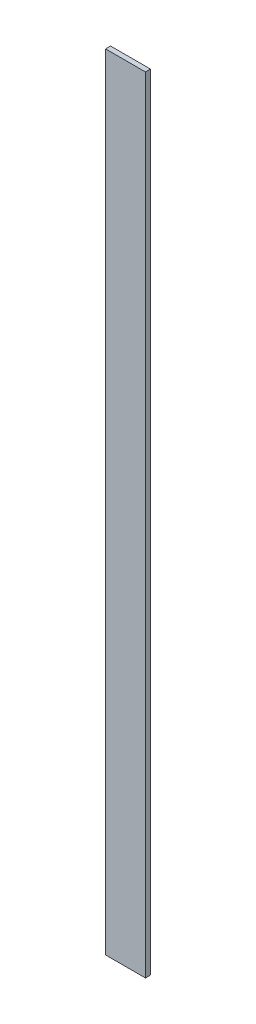
ISO-10303-21;
HEADER;
FILE_DESCRIPTION(('STEP AP214'),'2;1');
FILE_NAME('part.step','',(''),(''),'','','');
FILE_SCHEMA(('AUTOMOTIVE_DESIGN { 1 0 10303 214 1 1 1 1 }'));
ENDSEC;
DATA;
#1=APPLICATION_CONTEXT('core data for automotive mechanical design processes');
#2=APPLICATION_PROTOCOL_DEFINITION('international standard','automotive_design',2000,#1);
#3=PRODUCT_CONTEXT('',#1,'mechanical');
#4=PRODUCT('Part','Part','',(#3));
#5=PRODUCT_RELATED_PRODUCT_CATEGORY('part','',(#4));
#6=PRODUCT_DEFINITION_FORMATION('','',#4);
#7=PRODUCT_DEFINITION_CONTEXT('part definition',#1,'design');
#8=PRODUCT_DEFINITION('design','',#6,#7);
#9=PRODUCT_DEFINITION_SHAPE('','',#8);
#10=(LENGTH_UNIT() NAMED_UNIT(*) SI_UNIT(.MILLI.,.METRE.));
#11=(NAMED_UNIT(*) PLANE_ANGLE_UNIT() SI_UNIT($,.RADIAN.));
#12=(NAMED_UNIT(*) SI_UNIT($,.STERADIAN.) SOLID_ANGLE_UNIT());
#13=UNCERTAINTY_MEASURE_WITH_UNIT(LENGTH_MEASURE(1.E-05),#10,'distance_accuracy_value','');
#14=(GEOMETRIC_REPRESENTATION_CONTEXT(3) GLOBAL_UNCERTAINTY_ASSIGNED_CONTEXT((#13)) GLOBAL_UNIT_ASSIGNED_CONTEXT((#10,
#11,#12)) REPRESENTATION_CONTEXT('',''));
#15=CARTESIAN_POINT('',(0.,0.,0.));
#16=DIRECTION('',(0.,0.,1.));
#17=DIRECTION('',(1.,0.,0.));
#18=AXIS2_PLACEMENT_3D('',#15,#16,#17);
#19=CARTESIAN_POINT('',(0.,0.,2.38125));
#20=DIRECTION('',(0.,0.,1.));
#21=DIRECTION('',(1.,0.,0.));
#22=AXIS2_PLACEMENT_3D('',#19,#20,#21);
#23=PLANE('',#22);
#24=DIRECTION('',(1.,0.,0.));
#25=VECTOR('',#24,1.);
#26=CARTESIAN_POINT('',(9.525,187.325,2.38125));
#27=LINE('',#26,#25);
#28=CARTESIAN_POINT('',(-9.525,187.325,2.38125));
#29=VERTEX_POINT('',#28);
#30=CARTESIAN_POINT('',(9.525,187.325,2.38125));
#31=VERTEX_POINT('',#30);
#32=EDGE_CURVE('E67',#29,#31,#27,.T.);
#33=ORIENTED_EDGE('',*,*,#32,.F.);
#34=DIRECTION('',(0.,1.,0.));
#35=VECTOR('',#34,1.);
#36=CARTESIAN_POINT('',(-9.525,187.325,2.38125));
#37=LINE('',#36,#35);
#38=CARTESIAN_POINT('',(-9.525,-187.325,2.38125));
#39=VERTEX_POINT('',#38);
#40=EDGE_CURVE('E19',#39,#29,#37,.T.);
#41=ORIENTED_EDGE('',*,*,#40,.F.);
#42=DIRECTION('',(1.,0.,0.));
#43=VECTOR('',#42,1.);
#44=CARTESIAN_POINT('',(-9.525,-187.325,2.38125));
#45=LINE('',#44,#43);
#46=CARTESIAN_POINT('',(9.525,-187.325,2.38125));
#47=VERTEX_POINT('',#46);
#48=EDGE_CURVE('E57',#47,#39,#45,.F.);
#49=ORIENTED_EDGE('',*,*,#48,.F.);
#50=DIRECTION('',(0.,1.,0.));
#51=VECTOR('',#50,1.);
#52=CARTESIAN_POINT('',(9.525,-187.325,2.38125));
#53=LINE('',#52,#51);
#54=EDGE_CURVE('E52',#31,#47,#53,.F.);
#55=ORIENTED_EDGE('',*,*,#54,.F.);
#56=EDGE_LOOP('',(#33,#41,#49,#55));
#57=FACE_BOUND('',#56,.T.);
#58=ADVANCED_FACE('F16',(#57),#23,.T.);
#59=CARTESIAN_POINT('',(-9.525,187.325,0.));
#60=DIRECTION('',(-1.,0.,0.));
#61=DIRECTION('',(0.,0.,1.));
#62=AXIS2_PLACEMENT_3D('',#59,#60,#61);
#63=PLANE('',#62);
#64=DIRECTION('',(0.,0.,1.));
#65=VECTOR('',#64,1.);
#66=CARTESIAN_POINT('',(-9.525,187.325,0.));
#67=LINE('',#66,#65);
#68=CARTESIAN_POINT('',(-9.525,187.325,0.));
#69=VERTEX_POINT('',#68);
#70=EDGE_CURVE('E78',#69,#29,#67,.T.);
#71=ORIENTED_EDGE('',*,*,#70,.F.);
#72=DIRECTION('',(0.,1.,0.));
#73=VECTOR('',#72,1.);
#74=CARTESIAN_POINT('',(-9.525,0.,0.));
#75=LINE('',#74,#73);
#76=CARTESIAN_POINT('',(-9.525,-187.325,0.));
#77=VERTEX_POINT('',#76);
#78=EDGE_CURVE('E73',#69,#77,#75,.F.);
#79=ORIENTED_EDGE('',*,*,#78,.T.);
#80=DIRECTION('',(0.,0.,-1.));
#81=VECTOR('',#80,1.);
#82=CARTESIAN_POINT('',(-9.525,-187.325,0.));
#83=LINE('',#82,#81);
#84=EDGE_CURVE('E62',#39,#77,#83,.T.);
#85=ORIENTED_EDGE('',*,*,#84,.F.);
#86=ORIENTED_EDGE('',*,*,#40,.T.);
#87=EDGE_LOOP('',(#71,#79,#85,#86));
#88=FACE_BOUND('',#87,.T.);
#89=ADVANCED_FACE('F72',(#88),#63,.T.);
#90=CARTESIAN_POINT('',(-9.525,-187.325,0.));
#91=DIRECTION('',(0.,-1.,0.));
#92=DIRECTION('',(0.,0.,-1.));
#93=AXIS2_PLACEMENT_3D('',#90,#91,#92);
#94=PLANE('',#93);
#95=ORIENTED_EDGE('',*,*,#84,.T.);
#96=DIRECTION('',(1.,0.,0.));
#97=VECTOR('',#96,1.);
#98=CARTESIAN_POINT('',(0.,-187.325,0.));
#99=LINE('',#98,#97);
#100=CARTESIAN_POINT('',(9.525,-187.325,0.));
#101=VERTEX_POINT('',#100);
#102=EDGE_CURVE('E83',#77,#101,#99,.T.);
#103=ORIENTED_EDGE('',*,*,#102,.T.);
#104=DIRECTION('',(0.,0.,-1.));
#105=VECTOR('',#104,1.);
#106=CARTESIAN_POINT('',(9.525,-187.325,0.));
#107=LINE('',#106,#105);
#108=EDGE_CURVE('E64',#47,#101,#107,.T.);
#109=ORIENTED_EDGE('',*,*,#108,.F.);
#110=ORIENTED_EDGE('',*,*,#48,.T.);
#111=EDGE_LOOP('',(#95,#103,#109,#110));
#112=FACE_BOUND('',#111,.T.);
#113=ADVANCED_FACE('F59',(#112),#94,.T.);
#114=CARTESIAN_POINT('',(9.525,-187.325,0.));
#115=DIRECTION('',(1.,0.,0.));
#116=DIRECTION('',(0.,0.,-1.));
#117=AXIS2_PLACEMENT_3D('',#114,#115,#116);
#118=PLANE('',#117);
#119=ORIENTED_EDGE('',*,*,#108,.T.);
#120=DIRECTION('',(0.,1.,0.));
#121=VECTOR('',#120,1.);
#122=CARTESIAN_POINT('',(9.525,0.,0.));
#123=LINE('',#122,#121);
#124=CARTESIAN_POINT('',(9.525,187.325,0.));
#125=VERTEX_POINT('',#124);
#126=EDGE_CURVE('E25',#101,#125,#123,.T.);
#127=ORIENTED_EDGE('',*,*,#126,.T.);
#128=DIRECTION('',(0.,0.,1.));
#129=VECTOR('',#128,1.);
#130=CARTESIAN_POINT('',(9.525,187.325,0.));
#131=LINE('',#130,#129);
#132=EDGE_CURVE('E33',#31,#125,#131,.F.);
#133=ORIENTED_EDGE('',*,*,#132,.F.);
#134=ORIENTED_EDGE('',*,*,#54,.T.);
#135=EDGE_LOOP('',(#119,#127,#133,#134));
#136=FACE_BOUND('',#135,.T.);
#137=ADVANCED_FACE('F87',(#136),#118,.T.);
#138=CARTESIAN_POINT('',(9.525,187.325,0.));
#139=DIRECTION('',(0.,1.,0.));
#140=DIRECTION('',(0.,0.,1.));
#141=AXIS2_PLACEMENT_3D('',#138,#139,#140);
#142=PLANE('',#141);
#143=ORIENTED_EDGE('',*,*,#132,.T.);
#144=DIRECTION('',(1.,0.,0.));
#145=VECTOR('',#144,1.);
#146=CARTESIAN_POINT('',(0.,187.325,0.));
#147=LINE('',#146,#145);
#148=EDGE_CURVE('E11',#125,#69,#147,.F.);
#149=ORIENTED_EDGE('',*,*,#148,.T.);
#150=ORIENTED_EDGE('',*,*,#70,.T.);
#151=ORIENTED_EDGE('',*,*,#32,.T.);
#152=EDGE_LOOP('',(#143,#149,#150,#151));
#153=FACE_BOUND('',#152,.T.);
#154=ADVANCED_FACE('F90',(#153),#142,.T.);
#155=CARTESIAN_POINT('',(0.,0.,0.));
#156=DIRECTION('',(0.,0.,1.));
#157=DIRECTION('',(1.,0.,0.));
#158=AXIS2_PLACEMENT_3D('',#155,#156,#157);
#159=PLANE('',#158);
#160=ORIENTED_EDGE('',*,*,#126,.F.);
#161=ORIENTED_EDGE('',*,*,#102,.F.);
#162=ORIENTED_EDGE('',*,*,#78,.F.);
#163=ORIENTED_EDGE('',*,*,#148,.F.);
#164=EDGE_LOOP('',(#160,#161,#162,#163));
#165=FACE_BOUND('',#164,.T.);
#166=ADVANCED_FACE('F89',(#165),#159,.F.);
#167=CLOSED_SHELL('',(#58,#89,#113,#137,#154,#166));
#168=MANIFOLD_SOLID_BREP('B1',#167);
#169=ADVANCED_BREP_SHAPE_REPRESENTATION('',(#18,#168),#14);
#170=SHAPE_DEFINITION_REPRESENTATION(#9,#169);
ENDSEC;
END-ISO-10303-21;
